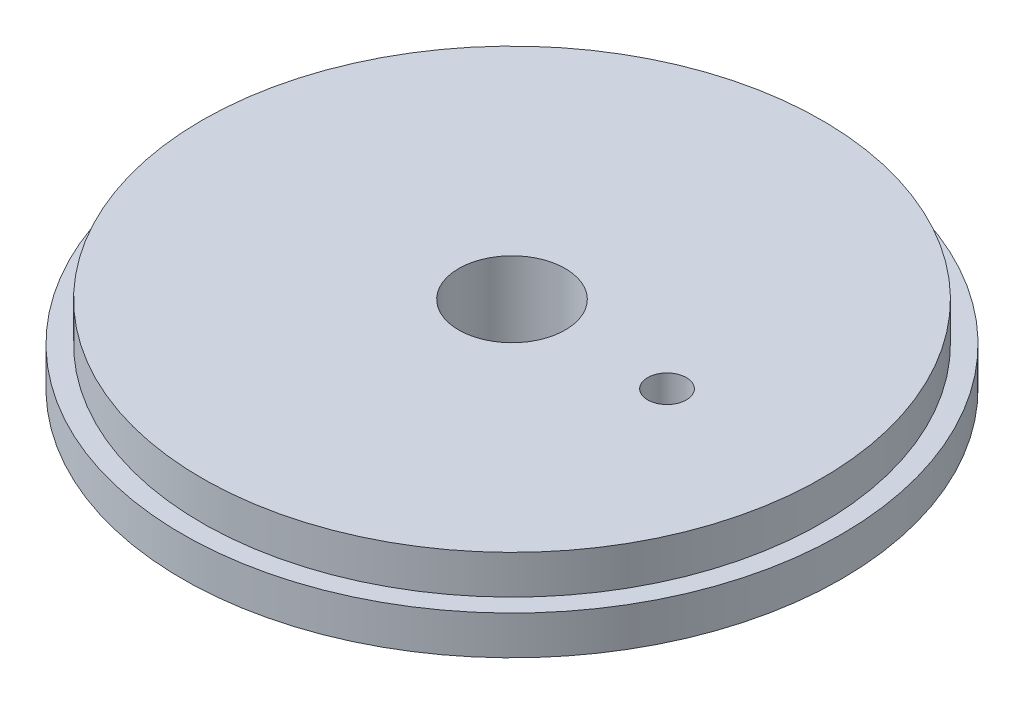
ISO-10303-21;
HEADER;
FILE_DESCRIPTION(('STEP AP214'),'2;1');
FILE_NAME('part.step','',(''),(''),'','','');
FILE_SCHEMA(('AUTOMOTIVE_DESIGN { 1 0 10303 214 1 1 1 1 }'));
ENDSEC;
DATA;
#1=APPLICATION_CONTEXT('core data for automotive mechanical design processes');
#2=APPLICATION_PROTOCOL_DEFINITION('international standard','automotive_design',2000,#1);
#3=PRODUCT_CONTEXT('',#1,'mechanical');
#4=PRODUCT('Part','Part','',(#3));
#5=PRODUCT_RELATED_PRODUCT_CATEGORY('part','',(#4));
#6=PRODUCT_DEFINITION_FORMATION('','',#4);
#7=PRODUCT_DEFINITION_CONTEXT('part definition',#1,'design');
#8=PRODUCT_DEFINITION('design','',#6,#7);
#9=PRODUCT_DEFINITION_SHAPE('','',#8);
#10=(LENGTH_UNIT() NAMED_UNIT(*) SI_UNIT(.MILLI.,.METRE.));
#11=(NAMED_UNIT(*) PLANE_ANGLE_UNIT() SI_UNIT($,.RADIAN.));
#12=(NAMED_UNIT(*) SI_UNIT($,.STERADIAN.) SOLID_ANGLE_UNIT());
#13=UNCERTAINTY_MEASURE_WITH_UNIT(LENGTH_MEASURE(1.E-05),#10,'distance_accuracy_value','');
#14=(GEOMETRIC_REPRESENTATION_CONTEXT(3) GLOBAL_UNCERTAINTY_ASSIGNED_CONTEXT((#13)) GLOBAL_UNIT_ASSIGNED_CONTEXT((#10,
#11,#12)) REPRESENTATION_CONTEXT('',''));
#15=CARTESIAN_POINT('',(0.,0.,0.));
#16=DIRECTION('',(0.,0.,1.));
#17=DIRECTION('',(1.,0.,0.));
#18=AXIS2_PLACEMENT_3D('',#15,#16,#17);
#19=CARTESIAN_POINT('',(0.,0.,0.));
#20=DIRECTION('',(0.,-1.,0.));
#21=DIRECTION('',(1.,0.,0.));
#22=AXIS2_PLACEMENT_3D('',#19,#20,#21);
#23=PLANE('',#22);
#24=CARTESIAN_POINT('',(0.,0.,12.7));
#25=DIRECTION('',(0.,-1.,0.));
#26=DIRECTION('',(1.,0.,0.));
#27=AXIS2_PLACEMENT_3D('',#24,#25,#26);
#28=CIRCLE('',#27,3.96875);
#29=CARTESIAN_POINT('',(3.96875,0.,12.7));
#30=VERTEX_POINT('',#29);
#31=EDGE_CURVE('E66',#30,#30,#28,.T.);
#32=ORIENTED_EDGE('',*,*,#31,.F.);
#33=EDGE_LOOP('',(#32));
#34=FACE_BOUND('',#33,.T.);
#35=CARTESIAN_POINT('',(0.,0.,0.));
#36=DIRECTION('',(0.,1.,0.));
#37=DIRECTION('',(-1.,0.,0.));
#38=AXIS2_PLACEMENT_3D('',#35,#36,#37);
#39=CIRCLE('',#38,4.365625);
#40=CARTESIAN_POINT('',(-4.365625,0.,0.));
#41=VERTEX_POINT('',#40);
#42=EDGE_CURVE('E52',#41,#41,#39,.T.);
#43=ORIENTED_EDGE('',*,*,#42,.T.);
#44=EDGE_LOOP('',(#43));
#45=FACE_BOUND('',#44,.T.);
#46=CARTESIAN_POINT('',(12.7,0.,0.));
#47=DIRECTION('',(0.,1.,0.));
#48=DIRECTION('',(-1.,0.,0.));
#49=AXIS2_PLACEMENT_3D('',#46,#47,#48);
#50=CIRCLE('',#49,1.5875);
#51=CARTESIAN_POINT('',(11.1125,0.,0.));
#52=VERTEX_POINT('',#51);
#53=EDGE_CURVE('E58',#52,#52,#50,.T.);
#54=ORIENTED_EDGE('',*,*,#53,.T.);
#55=EDGE_LOOP('',(#54));
#56=FACE_BOUND('',#55,.T.);
#57=CARTESIAN_POINT('',(0.,0.,0.));
#58=DIRECTION('',(0.,1.,0.));
#59=DIRECTION('',(-1.,0.,0.));
#60=AXIS2_PLACEMENT_3D('',#57,#58,#59);
#61=CIRCLE('',#60,27.);
#62=CARTESIAN_POINT('',(-27.,0.,0.));
#63=VERTEX_POINT('',#62);
#64=EDGE_CURVE('E10',#63,#63,#61,.T.);
#65=ORIENTED_EDGE('',*,*,#64,.F.);
#66=EDGE_LOOP('',(#65));
#67=FACE_BOUND('',#66,.T.);
#68=ADVANCED_FACE('F35',(#34,#45,#56,#67),#23,.T.);
#69=CARTESIAN_POINT('',(0.,6.35,0.));
#70=DIRECTION('',(0.,1.,0.));
#71=DIRECTION('',(-1.,0.,0.));
#72=AXIS2_PLACEMENT_3D('',#69,#70,#71);
#73=CYLINDRICAL_SURFACE('',#72,27.);
#74=ORIENTED_EDGE('',*,*,#64,.T.);
#75=EDGE_LOOP('',(#74));
#76=FACE_BOUND('',#75,.T.);
#77=CARTESIAN_POINT('',(0.,3.175,0.));
#78=DIRECTION('',(0.,1.,0.));
#79=DIRECTION('',(-1.,0.,0.));
#80=AXIS2_PLACEMENT_3D('',#77,#78,#79);
#81=CIRCLE('',#80,27.);
#82=CARTESIAN_POINT('',(-27.,3.175,0.));
#83=VERTEX_POINT('',#82);
#84=EDGE_CURVE('E42',#83,#83,#81,.T.);
#85=ORIENTED_EDGE('',*,*,#84,.F.);
#86=EDGE_LOOP('',(#85));
#87=FACE_BOUND('',#86,.T.);
#88=ADVANCED_FACE('F78',(#76,#87),#73,.T.);
#89=CARTESIAN_POINT('',(-27.,3.175,0.));
#90=DIRECTION('',(0.,1.,0.));
#91=DIRECTION('',(-1.,0.,0.));
#92=AXIS2_PLACEMENT_3D('',#89,#90,#91);
#93=PLANE('',#92);
#94=ORIENTED_EDGE('',*,*,#84,.T.);
#95=EDGE_LOOP('',(#94));
#96=FACE_BOUND('',#95,.T.);
#97=CARTESIAN_POINT('',(0.,3.175,0.));
#98=DIRECTION('',(0.,1.,0.));
#99=DIRECTION('',(-1.,0.,0.));
#100=AXIS2_PLACEMENT_3D('',#97,#98,#99);
#101=CIRCLE('',#100,25.4);
#102=CARTESIAN_POINT('',(-25.4,3.175,0.));
#103=VERTEX_POINT('',#102);
#104=EDGE_CURVE('E47',#103,#103,#101,.T.);
#105=ORIENTED_EDGE('',*,*,#104,.F.);
#106=EDGE_LOOP('',(#105));
#107=FACE_BOUND('',#106,.T.);
#108=ADVANCED_FACE('F76',(#96,#107),#93,.T.);
#109=CARTESIAN_POINT('',(0.,6.35,0.));
#110=DIRECTION('',(0.,1.,0.));
#111=DIRECTION('',(-1.,0.,0.));
#112=AXIS2_PLACEMENT_3D('',#109,#110,#111);
#113=CYLINDRICAL_SURFACE('',#112,25.4);
#114=ORIENTED_EDGE('',*,*,#104,.T.);
#115=EDGE_LOOP('',(#114));
#116=FACE_BOUND('',#115,.T.);
#117=CARTESIAN_POINT('',(0.,6.35,0.));
#118=DIRECTION('',(0.,1.,0.));
#119=DIRECTION('',(-1.,0.,0.));
#120=AXIS2_PLACEMENT_3D('',#117,#118,#119);
#121=CIRCLE('',#120,25.4);
#122=CARTESIAN_POINT('',(-25.4,6.35,0.));
#123=VERTEX_POINT('',#122);
#124=EDGE_CURVE('E56',#123,#123,#121,.T.);
#125=ORIENTED_EDGE('',*,*,#124,.F.);
#126=EDGE_LOOP('',(#125));
#127=FACE_BOUND('',#126,.T.);
#128=ADVANCED_FACE('F73',(#116,#127),#113,.T.);
#129=CARTESIAN_POINT('',(-25.4,6.35,0.));
#130=DIRECTION('',(0.,1.,0.));
#131=DIRECTION('',(-1.,0.,0.));
#132=AXIS2_PLACEMENT_3D('',#129,#130,#131);
#133=PLANE('',#132);
#134=CARTESIAN_POINT('',(0.,6.35,0.));
#135=DIRECTION('',(0.,1.,0.));
#136=DIRECTION('',(-1.,0.,0.));
#137=AXIS2_PLACEMENT_3D('',#134,#135,#136);
#138=CIRCLE('',#137,4.365625);
#139=CARTESIAN_POINT('',(-4.365625,6.35,0.));
#140=VERTEX_POINT('',#139);
#141=EDGE_CURVE('E38',#140,#140,#138,.T.);
#142=ORIENTED_EDGE('',*,*,#141,.F.);
#143=EDGE_LOOP('',(#142));
#144=FACE_BOUND('',#143,.T.);
#145=CARTESIAN_POINT('',(12.7,6.35,0.));
#146=DIRECTION('',(0.,1.,0.));
#147=DIRECTION('',(-1.,0.,0.));
#148=AXIS2_PLACEMENT_3D('',#145,#146,#147);
#149=CIRCLE('',#148,1.5875);
#150=CARTESIAN_POINT('',(11.1125,6.35,0.));
#151=VERTEX_POINT('',#150);
#152=EDGE_CURVE('E50',#151,#151,#149,.T.);
#153=ORIENTED_EDGE('',*,*,#152,.F.);
#154=EDGE_LOOP('',(#153));
#155=FACE_BOUND('',#154,.T.);
#156=ORIENTED_EDGE('',*,*,#124,.T.);
#157=EDGE_LOOP('',(#156));
#158=FACE_BOUND('',#157,.T.);
#159=ADVANCED_FACE('F85',(#144,#155,#158),#133,.T.);
#160=CARTESIAN_POINT('',(12.7,0.,0.));
#161=DIRECTION('',(0.,1.,0.));
#162=DIRECTION('',(-1.,0.,0.));
#163=AXIS2_PLACEMENT_3D('',#160,#161,#162);
#164=CYLINDRICAL_SURFACE('',#163,1.5875);
#165=ORIENTED_EDGE('',*,*,#152,.T.);
#166=EDGE_LOOP('',(#165));
#167=FACE_BOUND('',#166,.T.);
#168=ORIENTED_EDGE('',*,*,#53,.F.);
#169=EDGE_LOOP('',(#168));
#170=FACE_BOUND('',#169,.T.);
#171=ADVANCED_FACE('F97',(#167,#170),#164,.F.);
#172=CARTESIAN_POINT('',(0.,0.,0.));
#173=DIRECTION('',(0.,1.,0.));
#174=DIRECTION('',(-1.,0.,0.));
#175=AXIS2_PLACEMENT_3D('',#172,#173,#174);
#176=CYLINDRICAL_SURFACE('',#175,4.365625);
#177=ORIENTED_EDGE('',*,*,#141,.T.);
#178=EDGE_LOOP('',(#177));
#179=FACE_BOUND('',#178,.T.);
#180=ORIENTED_EDGE('',*,*,#42,.F.);
#181=EDGE_LOOP('',(#180));
#182=FACE_BOUND('',#181,.T.);
#183=ADVANCED_FACE('F99',(#179,#182),#176,.F.);
#184=CARTESIAN_POINT('',(0.,3.175,12.7));
#185=DIRECTION('',(0.,-1.,0.));
#186=DIRECTION('',(1.,0.,0.));
#187=AXIS2_PLACEMENT_3D('',#184,#185,#186);
#188=CYLINDRICAL_SURFACE('',#187,3.96875);
#189=CARTESIAN_POINT('',(0.,3.175,12.7));
#190=DIRECTION('',(0.,-1.,0.));
#191=DIRECTION('',(1.,0.,0.));
#192=AXIS2_PLACEMENT_3D('',#189,#190,#191);
#193=CIRCLE('',#192,3.96875);
#194=CARTESIAN_POINT('',(3.96875,3.175,12.7));
#195=VERTEX_POINT('',#194);
#196=EDGE_CURVE('E63',#195,#195,#193,.T.);
#197=ORIENTED_EDGE('',*,*,#196,.F.);
#198=EDGE_LOOP('',(#197));
#199=FACE_BOUND('',#198,.T.);
#200=ORIENTED_EDGE('',*,*,#31,.T.);
#201=EDGE_LOOP('',(#200));
#202=FACE_BOUND('',#201,.T.);
#203=ADVANCED_FACE('F105',(#199,#202),#188,.F.);
#204=CARTESIAN_POINT('',(0.,3.175,12.7));
#205=DIRECTION('',(0.,-1.,0.));
#206=DIRECTION('',(1.,0.,0.));
#207=AXIS2_PLACEMENT_3D('',#204,#205,#206);
#208=PLANE('',#207);
#209=ORIENTED_EDGE('',*,*,#196,.T.);
#210=EDGE_LOOP('',(#209));
#211=FACE_BOUND('',#210,.T.);
#212=ADVANCED_FACE('F113',(#211),#208,.T.);
#213=CLOSED_SHELL('',(#68,#88,#108,#128,#159,#171,#183,#203,#212));
#214=MANIFOLD_SOLID_BREP('B2',#213);
#215=ADVANCED_BREP_SHAPE_REPRESENTATION('',(#18,#214),#14);
#216=SHAPE_DEFINITION_REPRESENTATION(#9,#215);
ENDSEC;
END-ISO-10303-21;
